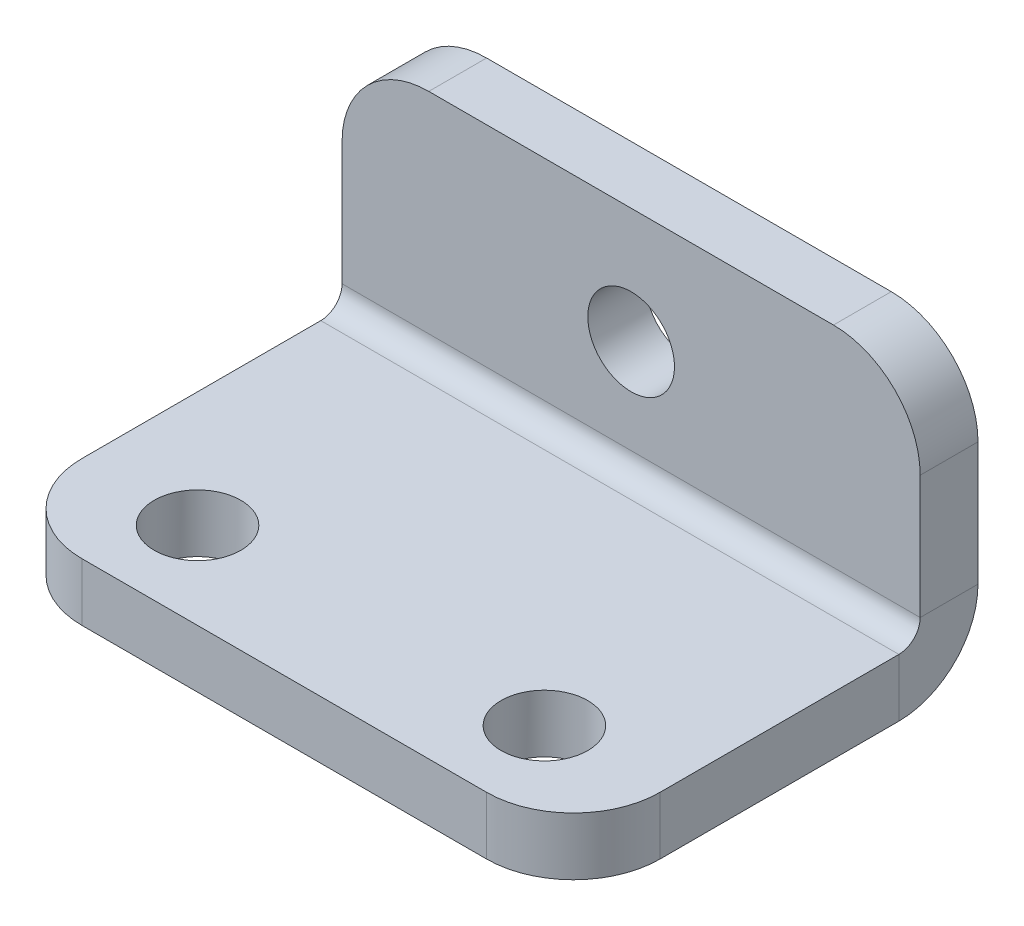
ISO-10303-21;
HEADER;
FILE_DESCRIPTION(('STEP AP214'),'2;1');
FILE_NAME('part.step','',(''),(''),'','','');
FILE_SCHEMA(('AUTOMOTIVE_DESIGN { 1 0 10303 214 1 1 1 1 }'));
ENDSEC;
DATA;
#1=APPLICATION_CONTEXT('core data for automotive mechanical design processes');
#2=APPLICATION_PROTOCOL_DEFINITION('international standard','automotive_design',2000,#1);
#3=PRODUCT_CONTEXT('',#1,'mechanical');
#4=PRODUCT('Part','Part','',(#3));
#5=PRODUCT_RELATED_PRODUCT_CATEGORY('part','',(#4));
#6=PRODUCT_DEFINITION_FORMATION('','',#4);
#7=PRODUCT_DEFINITION_CONTEXT('part definition',#1,'design');
#8=PRODUCT_DEFINITION('design','',#6,#7);
#9=PRODUCT_DEFINITION_SHAPE('','',#8);
#10=(LENGTH_UNIT() NAMED_UNIT(*) SI_UNIT(.MILLI.,.METRE.));
#11=(NAMED_UNIT(*) PLANE_ANGLE_UNIT() SI_UNIT($,.RADIAN.));
#12=(NAMED_UNIT(*) SI_UNIT($,.STERADIAN.) SOLID_ANGLE_UNIT());
#13=UNCERTAINTY_MEASURE_WITH_UNIT(LENGTH_MEASURE(1.E-05),#10,'distance_accuracy_value','');
#14=(GEOMETRIC_REPRESENTATION_CONTEXT(3) GLOBAL_UNCERTAINTY_ASSIGNED_CONTEXT((#13)) GLOBAL_UNIT_ASSIGNED_CONTEXT((#10,
#11,#12)) REPRESENTATION_CONTEXT('',''));
#15=CARTESIAN_POINT('',(0.,0.,0.));
#16=DIRECTION('',(0.,0.,1.));
#17=DIRECTION('',(1.,0.,0.));
#18=AXIS2_PLACEMENT_3D('',#15,#16,#17);
#19=CARTESIAN_POINT('',(10.,0.7366,0.));
#20=DIRECTION('',(1.,0.,0.));
#21=DIRECTION('',(0.,0.,-1.));
#22=AXIS2_PLACEMENT_3D('',#19,#20,#21);
#23=PLANE('',#22);
#24=DIRECTION('',(0.,0.,-1.));
#25=VECTOR('',#24,1.);
#26=CARTESIAN_POINT('',(10.,0.7366,0.));
#27=LINE('',#26,#25);
#28=CARTESIAN_POINT('',(10.,0.7366,0.));
#29=VERTEX_POINT('',#28);
#30=CARTESIAN_POINT('',(10.,0.7366,-2.));
#31=VERTEX_POINT('',#30);
#32=EDGE_CURVE('E139',#29,#31,#27,.T.);
#33=ORIENTED_EDGE('',*,*,#32,.F.);
#34=CARTESIAN_POINT('',(10.,0.7366,0.7366));
#35=DIRECTION('',(1.,0.,0.));
#36=DIRECTION('',(0.,0.,-1.));
#37=AXIS2_PLACEMENT_3D('',#34,#35,#36);
#38=CIRCLE('',#37,0.7366);
#39=CARTESIAN_POINT('',(10.,0.,0.7366));
#40=VERTEX_POINT('',#39);
#41=EDGE_CURVE('E134',#29,#40,#38,.F.);
#42=ORIENTED_EDGE('',*,*,#41,.T.);
#43=DIRECTION('',(0.,1.,0.));
#44=VECTOR('',#43,1.);
#45=CARTESIAN_POINT('',(10.,-2.,0.7366));
#46=LINE('',#45,#44);
#47=CARTESIAN_POINT('',(10.,-2.,0.7366));
#48=VERTEX_POINT('',#47);
#49=EDGE_CURVE('E128',#48,#40,#46,.T.);
#50=ORIENTED_EDGE('',*,*,#49,.F.);
#51=CARTESIAN_POINT('',(10.,0.7366,0.7366));
#52=DIRECTION('',(1.,0.,0.));
#53=DIRECTION('',(0.,0.,-1.));
#54=AXIS2_PLACEMENT_3D('',#51,#52,#53);
#55=CIRCLE('',#54,2.7366);
#56=EDGE_CURVE('E132',#31,#48,#55,.F.);
#57=ORIENTED_EDGE('',*,*,#56,.F.);
#58=EDGE_LOOP('',(#33,#42,#50,#57));
#59=FACE_BOUND('',#58,.T.);
#60=ADVANCED_FACE('F36',(#59),#23,.T.);
#61=CARTESIAN_POINT('',(10.,-2.,0.7366));
#62=DIRECTION('',(1.,0.,0.));
#63=DIRECTION('',(0.,0.,-1.));
#64=AXIS2_PLACEMENT_3D('',#61,#62,#63);
#65=PLANE('',#64);
#66=DIRECTION('',(0.,1.,0.));
#67=VECTOR('',#66,1.);
#68=CARTESIAN_POINT('',(10.,8.,-2.));
#69=LINE('',#68,#67);
#70=CARTESIAN_POINT('',(10.,5.,-2.));
#71=VERTEX_POINT('',#70);
#72=EDGE_CURVE('E166',#71,#31,#69,.F.);
#73=ORIENTED_EDGE('',*,*,#72,.F.);
#74=DIRECTION('',(0.,0.,-1.));
#75=VECTOR('',#74,1.);
#76=CARTESIAN_POINT('',(10.,5.,0.7366));
#77=LINE('',#76,#75);
#78=CARTESIAN_POINT('',(10.,5.,0.));
#79=VERTEX_POINT('',#78);
#80=EDGE_CURVE('E45',#71,#79,#77,.F.);
#81=ORIENTED_EDGE('',*,*,#80,.T.);
#82=DIRECTION('',(0.,-1.,0.));
#83=VECTOR('',#82,1.);
#84=CARTESIAN_POINT('',(10.,8.,0.));
#85=LINE('',#84,#83);
#86=EDGE_CURVE('E168',#79,#29,#85,.T.);
#87=ORIENTED_EDGE('',*,*,#86,.T.);
#88=ORIENTED_EDGE('',*,*,#32,.T.);
#89=EDGE_LOOP('',(#73,#81,#87,#88));
#90=FACE_BOUND('',#89,.T.);
#91=ADVANCED_FACE('F290',(#90),#65,.T.);
#92=CARTESIAN_POINT('',(-10.,0.,0.7366));
#93=DIRECTION('',(-1.,0.,0.));
#94=DIRECTION('',(0.,0.,1.));
#95=AXIS2_PLACEMENT_3D('',#92,#93,#94);
#96=PLANE('',#95);
#97=DIRECTION('',(0.,-1.,0.));
#98=VECTOR('',#97,1.);
#99=CARTESIAN_POINT('',(-10.,0.,0.7366));
#100=LINE('',#99,#98);
#101=CARTESIAN_POINT('',(-10.,0.,0.7366));
#102=VERTEX_POINT('',#101);
#103=CARTESIAN_POINT('',(-10.,-2.,0.7366));
#104=VERTEX_POINT('',#103);
#105=EDGE_CURVE('E140',#102,#104,#100,.T.);
#106=ORIENTED_EDGE('',*,*,#105,.F.);
#107=CARTESIAN_POINT('',(-10.,0.7366,0.7366));
#108=DIRECTION('',(1.,0.,0.));
#109=DIRECTION('',(0.,0.,-1.));
#110=AXIS2_PLACEMENT_3D('',#107,#108,#109);
#111=CIRCLE('',#110,0.7366);
#112=CARTESIAN_POINT('',(-10.,0.7366,0.));
#113=VERTEX_POINT('',#112);
#114=EDGE_CURVE('E185',#113,#102,#111,.F.);
#115=ORIENTED_EDGE('',*,*,#114,.F.);
#116=DIRECTION('',(0.,0.,1.));
#117=VECTOR('',#116,1.);
#118=CARTESIAN_POINT('',(-10.,0.7366,-2.));
#119=LINE('',#118,#117);
#120=CARTESIAN_POINT('',(-10.,0.7366,-2.));
#121=VERTEX_POINT('',#120);
#122=EDGE_CURVE('E202',#121,#113,#119,.T.);
#123=ORIENTED_EDGE('',*,*,#122,.F.);
#124=CARTESIAN_POINT('',(-10.,0.7366,0.7366));
#125=DIRECTION('',(1.,0.,0.));
#126=DIRECTION('',(0.,0.,-1.));
#127=AXIS2_PLACEMENT_3D('',#124,#125,#126);
#128=CIRCLE('',#127,2.7366);
#129=EDGE_CURVE('E179',#121,#104,#128,.F.);
#130=ORIENTED_EDGE('',*,*,#129,.T.);
#131=EDGE_LOOP('',(#106,#115,#123,#130));
#132=FACE_BOUND('',#131,.T.);
#133=ADVANCED_FACE('F273',(#132),#96,.T.);
#134=CARTESIAN_POINT('',(-10.,0.7366,-2.));
#135=DIRECTION('',(-1.,0.,0.));
#136=DIRECTION('',(0.,0.,1.));
#137=AXIS2_PLACEMENT_3D('',#134,#135,#136);
#138=PLANE('',#137);
#139=DIRECTION('',(0.,0.,1.));
#140=VECTOR('',#139,1.);
#141=CARTESIAN_POINT('',(-10.,-2.,0.));
#142=LINE('',#141,#140);
#143=CARTESIAN_POINT('',(-10.,-2.,9.));
#144=VERTEX_POINT('',#143);
#145=EDGE_CURVE('E152',#104,#144,#142,.T.);
#146=ORIENTED_EDGE('',*,*,#145,.T.);
#147=DIRECTION('',(0.,1.,0.));
#148=VECTOR('',#147,1.);
#149=CARTESIAN_POINT('',(-10.,0.7366,9.));
#150=LINE('',#149,#148);
#151=CARTESIAN_POINT('',(-10.,0.,9.));
#152=VERTEX_POINT('',#151);
#153=EDGE_CURVE('E208',#144,#152,#150,.T.);
#154=ORIENTED_EDGE('',*,*,#153,.T.);
#155=DIRECTION('',(0.,0.,1.));
#156=VECTOR('',#155,1.);
#157=CARTESIAN_POINT('',(-10.,0.,0.));
#158=LINE('',#157,#156);
#159=EDGE_CURVE('E175',#102,#152,#158,.T.);
#160=ORIENTED_EDGE('',*,*,#159,.F.);
#161=ORIENTED_EDGE('',*,*,#105,.T.);
#162=EDGE_LOOP('',(#146,#154,#160,#161));
#163=FACE_BOUND('',#162,.T.);
#164=ADVANCED_FACE('F269',(#163),#138,.T.);
#165=CARTESIAN_POINT('',(10.,0.,0.));
#166=DIRECTION('',(0.,-1.,0.));
#167=DIRECTION('',(0.,0.,-1.));
#168=AXIS2_PLACEMENT_3D('',#165,#166,#167);
#169=PLANE('',#168);
#170=CARTESIAN_POINT('',(-6.,0.,9.));
#171=DIRECTION('',(0.,1.,0.));
#172=DIRECTION('',(0.,0.,1.));
#173=AXIS2_PLACEMENT_3D('',#170,#171,#172);
#174=CIRCLE('',#173,1.5);
#175=CARTESIAN_POINT('',(-6.,0.,10.5));
#176=VERTEX_POINT('',#175);
#177=EDGE_CURVE('E241',#176,#176,#174,.T.);
#178=ORIENTED_EDGE('',*,*,#177,.F.);
#179=EDGE_LOOP('',(#178));
#180=FACE_BOUND('',#179,.T.);
#181=CARTESIAN_POINT('',(6.,0.,9.));
#182=DIRECTION('',(0.,1.,0.));
#183=DIRECTION('',(0.,0.,1.));
#184=AXIS2_PLACEMENT_3D('',#181,#182,#183);
#185=CIRCLE('',#184,1.5);
#186=CARTESIAN_POINT('',(6.,0.,10.5));
#187=VERTEX_POINT('',#186);
#188=EDGE_CURVE('E246',#187,#187,#185,.T.);
#189=ORIENTED_EDGE('',*,*,#188,.F.);
#190=EDGE_LOOP('',(#189));
#191=FACE_BOUND('',#190,.T.);
#192=ORIENTED_EDGE('',*,*,#159,.T.);
#193=CARTESIAN_POINT('',(-7.,0.,9.));
#194=DIRECTION('',(0.,-1.,0.));
#195=DIRECTION('',(0.,0.,-1.));
#196=AXIS2_PLACEMENT_3D('',#193,#194,#195);
#197=CIRCLE('',#196,3.);
#198=CARTESIAN_POINT('',(-7.,0.,12.));
#199=VERTEX_POINT('',#198);
#200=EDGE_CURVE('E213',#152,#199,#197,.F.);
#201=ORIENTED_EDGE('',*,*,#200,.T.);
#202=DIRECTION('',(-1.,0.,0.));
#203=VECTOR('',#202,1.);
#204=CARTESIAN_POINT('',(10.,0.,12.));
#205=LINE('',#204,#203);
#206=CARTESIAN_POINT('',(7.,0.,12.));
#207=VERTEX_POINT('',#206);
#208=EDGE_CURVE('E199',#207,#199,#205,.T.);
#209=ORIENTED_EDGE('',*,*,#208,.F.);
#210=CARTESIAN_POINT('',(7.,0.,9.));
#211=DIRECTION('',(0.,-1.,0.));
#212=DIRECTION('',(0.,0.,-1.));
#213=AXIS2_PLACEMENT_3D('',#210,#211,#212);
#214=CIRCLE('',#213,3.);
#215=CARTESIAN_POINT('',(10.,0.,9.));
#216=VERTEX_POINT('',#215);
#217=EDGE_CURVE('E211',#207,#216,#214,.F.);
#218=ORIENTED_EDGE('',*,*,#217,.T.);
#219=DIRECTION('',(0.,0.,1.));
#220=VECTOR('',#219,1.);
#221=CARTESIAN_POINT('',(10.,0.,0.));
#222=LINE('',#221,#220);
#223=EDGE_CURVE('E161',#40,#216,#222,.T.);
#224=ORIENTED_EDGE('',*,*,#223,.F.);
#225=DIRECTION('',(-1.,0.,0.));
#226=VECTOR('',#225,1.);
#227=CARTESIAN_POINT('',(10.,0.,0.7366));
#228=LINE('',#227,#226);
#229=EDGE_CURVE('E174',#40,#102,#228,.T.);
#230=ORIENTED_EDGE('',*,*,#229,.T.);
#231=EDGE_LOOP('',(#192,#201,#209,#218,#224,#230));
#232=FACE_BOUND('',#231,.T.);
#233=ADVANCED_FACE('F278',(#180,#191,#232),#169,.F.);
#234=CARTESIAN_POINT('',(10.,-2.,12.));
#235=DIRECTION('',(0.,0.,1.));
#236=DIRECTION('',(1.,0.,0.));
#237=AXIS2_PLACEMENT_3D('',#234,#235,#236);
#238=PLANE('',#237);
#239=ORIENTED_EDGE('',*,*,#208,.T.);
#240=DIRECTION('',(0.,1.,0.));
#241=VECTOR('',#240,1.);
#242=CARTESIAN_POINT('',(-7.,-2.,12.));
#243=LINE('',#242,#241);
#244=CARTESIAN_POINT('',(-7.,-2.,12.));
#245=VERTEX_POINT('',#244);
#246=EDGE_CURVE('E218',#199,#245,#243,.F.);
#247=ORIENTED_EDGE('',*,*,#246,.T.);
#248=DIRECTION('',(-1.,0.,0.));
#249=VECTOR('',#248,1.);
#250=CARTESIAN_POINT('',(10.,-2.,12.));
#251=LINE('',#250,#249);
#252=CARTESIAN_POINT('',(7.,-2.,12.));
#253=VERTEX_POINT('',#252);
#254=EDGE_CURVE('E156',#253,#245,#251,.T.);
#255=ORIENTED_EDGE('',*,*,#254,.F.);
#256=DIRECTION('',(0.,1.,0.));
#257=VECTOR('',#256,1.);
#258=CARTESIAN_POINT('',(7.,-2.,12.));
#259=LINE('',#258,#257);
#260=EDGE_CURVE('E215',#253,#207,#259,.T.);
#261=ORIENTED_EDGE('',*,*,#260,.T.);
#262=EDGE_LOOP('',(#239,#247,#255,#261));
#263=FACE_BOUND('',#262,.T.);
#264=ADVANCED_FACE('F262',(#263),#238,.T.);
#265=CARTESIAN_POINT('',(10.,-2.,0.));
#266=DIRECTION('',(0.,-1.,0.));
#267=DIRECTION('',(0.,0.,-1.));
#268=AXIS2_PLACEMENT_3D('',#265,#266,#267);
#269=PLANE('',#268);
#270=CARTESIAN_POINT('',(-6.,-2.,9.));
#271=DIRECTION('',(0.,-1.,0.));
#272=DIRECTION('',(0.,0.,-1.));
#273=AXIS2_PLACEMENT_3D('',#270,#271,#272);
#274=CIRCLE('',#273,1.5);
#275=CARTESIAN_POINT('',(-6.,-2.,7.5));
#276=VERTEX_POINT('',#275);
#277=EDGE_CURVE('E40',#276,#276,#274,.T.);
#278=ORIENTED_EDGE('',*,*,#277,.F.);
#279=EDGE_LOOP('',(#278));
#280=FACE_BOUND('',#279,.T.);
#281=CARTESIAN_POINT('',(6.,-2.,9.));
#282=DIRECTION('',(0.,-1.,0.));
#283=DIRECTION('',(0.,0.,-1.));
#284=AXIS2_PLACEMENT_3D('',#281,#282,#283);
#285=CIRCLE('',#284,1.5);
#286=CARTESIAN_POINT('',(6.,-2.,7.5));
#287=VERTEX_POINT('',#286);
#288=EDGE_CURVE('E239',#287,#287,#285,.T.);
#289=ORIENTED_EDGE('',*,*,#288,.F.);
#290=EDGE_LOOP('',(#289));
#291=FACE_BOUND('',#290,.T.);
#292=ORIENTED_EDGE('',*,*,#254,.T.);
#293=CARTESIAN_POINT('',(-7.,-2.,9.));
#294=DIRECTION('',(0.,-1.,0.));
#295=DIRECTION('',(0.,0.,-1.));
#296=AXIS2_PLACEMENT_3D('',#293,#294,#295);
#297=CIRCLE('',#296,3.);
#298=EDGE_CURVE('E222',#245,#144,#297,.T.);
#299=ORIENTED_EDGE('',*,*,#298,.T.);
#300=ORIENTED_EDGE('',*,*,#145,.F.);
#301=DIRECTION('',(-1.,0.,0.));
#302=VECTOR('',#301,1.);
#303=CARTESIAN_POINT('',(10.,-2.,0.7366));
#304=LINE('',#303,#302);
#305=EDGE_CURVE('E146',#48,#104,#304,.T.);
#306=ORIENTED_EDGE('',*,*,#305,.F.);
#307=DIRECTION('',(0.,0.,1.));
#308=VECTOR('',#307,1.);
#309=CARTESIAN_POINT('',(10.,-2.,0.));
#310=LINE('',#309,#308);
#311=CARTESIAN_POINT('',(10.,-2.,9.));
#312=VERTEX_POINT('',#311);
#313=EDGE_CURVE('E149',#48,#312,#310,.T.);
#314=ORIENTED_EDGE('',*,*,#313,.T.);
#315=CARTESIAN_POINT('',(7.,-2.,9.));
#316=DIRECTION('',(0.,-1.,0.));
#317=DIRECTION('',(0.,0.,-1.));
#318=AXIS2_PLACEMENT_3D('',#315,#316,#317);
#319=CIRCLE('',#318,3.);
#320=EDGE_CURVE('E220',#312,#253,#319,.T.);
#321=ORIENTED_EDGE('',*,*,#320,.T.);
#322=EDGE_LOOP('',(#292,#299,#300,#306,#314,#321));
#323=FACE_BOUND('',#322,.T.);
#324=ADVANCED_FACE('F148',(#280,#291,#323),#269,.T.);
#325=CARTESIAN_POINT('',(10.,0.7366,0.7366));
#326=DIRECTION('',(-1.,0.,0.));
#327=DIRECTION('',(0.,0.,1.));
#328=AXIS2_PLACEMENT_3D('',#325,#326,#327);
#329=CYLINDRICAL_SURFACE('',#328,2.7366);
#330=ORIENTED_EDGE('',*,*,#129,.F.);
#331=DIRECTION('',(-1.,0.,0.));
#332=VECTOR('',#331,1.);
#333=CARTESIAN_POINT('',(10.,0.7366,-2.));
#334=LINE('',#333,#332);
#335=EDGE_CURVE('E157',#31,#121,#334,.T.);
#336=ORIENTED_EDGE('',*,*,#335,.F.);
#337=ORIENTED_EDGE('',*,*,#56,.T.);
#338=ORIENTED_EDGE('',*,*,#305,.T.);
#339=EDGE_LOOP('',(#330,#336,#337,#338));
#340=FACE_BOUND('',#339,.T.);
#341=ADVANCED_FACE('F164',(#340),#329,.T.);
#342=CARTESIAN_POINT('',(10.,8.,-2.));
#343=DIRECTION('',(0.,0.,-1.));
#344=DIRECTION('',(-1.,0.,0.));
#345=AXIS2_PLACEMENT_3D('',#342,#343,#344);
#346=PLANE('',#345);
#347=CARTESIAN_POINT('',(0.,4.,-2.));
#348=DIRECTION('',(0.,0.,-1.));
#349=DIRECTION('',(-1.,0.,0.));
#350=AXIS2_PLACEMENT_3D('',#347,#348,#349);
#351=CIRCLE('',#350,1.5);
#352=CARTESIAN_POINT('',(-1.5,4.,-2.));
#353=VERTEX_POINT('',#352);
#354=EDGE_CURVE('E251',#353,#353,#351,.T.);
#355=ORIENTED_EDGE('',*,*,#354,.F.);
#356=EDGE_LOOP('',(#355));
#357=FACE_BOUND('',#356,.T.);
#358=DIRECTION('',(0.,1.,0.));
#359=VECTOR('',#358,1.);
#360=CARTESIAN_POINT('',(-10.,8.,-2.));
#361=LINE('',#360,#359);
#362=CARTESIAN_POINT('',(-10.,5.,-2.));
#363=VERTEX_POINT('',#362);
#364=EDGE_CURVE('E181',#363,#121,#361,.F.);
#365=ORIENTED_EDGE('',*,*,#364,.F.);
#366=CARTESIAN_POINT('',(-7.,5.,-2.));
#367=DIRECTION('',(0.,0.,-1.));
#368=DIRECTION('',(-1.,0.,0.));
#369=AXIS2_PLACEMENT_3D('',#366,#367,#368);
#370=CIRCLE('',#369,3.);
#371=CARTESIAN_POINT('',(-7.,8.,-2.));
#372=VERTEX_POINT('',#371);
#373=EDGE_CURVE('E229',#363,#372,#370,.T.);
#374=ORIENTED_EDGE('',*,*,#373,.T.);
#375=DIRECTION('',(-1.,0.,0.));
#376=VECTOR('',#375,1.);
#377=CARTESIAN_POINT('',(10.,8.,-2.));
#378=LINE('',#377,#376);
#379=CARTESIAN_POINT('',(7.,8.,-2.));
#380=VERTEX_POINT('',#379);
#381=EDGE_CURVE('E195',#380,#372,#378,.T.);
#382=ORIENTED_EDGE('',*,*,#381,.F.);
#383=CARTESIAN_POINT('',(7.,5.,-2.));
#384=DIRECTION('',(0.,0.,-1.));
#385=DIRECTION('',(-1.,0.,0.));
#386=AXIS2_PLACEMENT_3D('',#383,#384,#385);
#387=CIRCLE('',#386,3.);
#388=EDGE_CURVE('E227',#380,#71,#387,.T.);
#389=ORIENTED_EDGE('',*,*,#388,.T.);
#390=ORIENTED_EDGE('',*,*,#72,.T.);
#391=ORIENTED_EDGE('',*,*,#335,.T.);
#392=EDGE_LOOP('',(#365,#374,#382,#389,#390,#391));
#393=FACE_BOUND('',#392,.T.);
#394=ADVANCED_FACE('F320',(#357,#393),#346,.T.);
#395=CARTESIAN_POINT('',(10.,8.,0.));
#396=DIRECTION('',(0.,1.,0.));
#397=DIRECTION('',(0.,0.,1.));
#398=AXIS2_PLACEMENT_3D('',#395,#396,#397);
#399=PLANE('',#398);
#400=ORIENTED_EDGE('',*,*,#381,.T.);
#401=DIRECTION('',(0.,0.,-1.));
#402=VECTOR('',#401,1.);
#403=CARTESIAN_POINT('',(-7.,8.,0.));
#404=LINE('',#403,#402);
#405=CARTESIAN_POINT('',(-7.,8.,0.));
#406=VERTEX_POINT('',#405);
#407=EDGE_CURVE('E60',#372,#406,#404,.F.);
#408=ORIENTED_EDGE('',*,*,#407,.T.);
#409=DIRECTION('',(-1.,0.,0.));
#410=VECTOR('',#409,1.);
#411=CARTESIAN_POINT('',(10.,8.,0.));
#412=LINE('',#411,#410);
#413=CARTESIAN_POINT('',(7.,8.,0.));
#414=VERTEX_POINT('',#413);
#415=EDGE_CURVE('E193',#414,#406,#412,.T.);
#416=ORIENTED_EDGE('',*,*,#415,.F.);
#417=DIRECTION('',(0.,0.,-1.));
#418=VECTOR('',#417,1.);
#419=CARTESIAN_POINT('',(7.,8.,0.));
#420=LINE('',#419,#418);
#421=EDGE_CURVE('E231',#414,#380,#420,.T.);
#422=ORIENTED_EDGE('',*,*,#421,.T.);
#423=EDGE_LOOP('',(#400,#408,#416,#422));
#424=FACE_BOUND('',#423,.T.);
#425=ADVANCED_FACE('F316',(#424),#399,.T.);
#426=CARTESIAN_POINT('',(10.,8.,0.));
#427=DIRECTION('',(0.,0.,-1.));
#428=DIRECTION('',(-1.,0.,0.));
#429=AXIS2_PLACEMENT_3D('',#426,#427,#428);
#430=PLANE('',#429);
#431=CARTESIAN_POINT('',(0.,4.,0.));
#432=DIRECTION('',(0.,0.,1.));
#433=DIRECTION('',(1.,0.,0.));
#434=AXIS2_PLACEMENT_3D('',#431,#432,#433);
#435=CIRCLE('',#434,1.5);
#436=CARTESIAN_POINT('',(1.5,4.,0.));
#437=VERTEX_POINT('',#436);
#438=EDGE_CURVE('E517',#437,#437,#435,.T.);
#439=ORIENTED_EDGE('',*,*,#438,.F.);
#440=EDGE_LOOP('',(#439));
#441=FACE_BOUND('',#440,.T.);
#442=ORIENTED_EDGE('',*,*,#415,.T.);
#443=CARTESIAN_POINT('',(-7.,5.,0.));
#444=DIRECTION('',(0.,0.,-1.));
#445=DIRECTION('',(-1.,0.,0.));
#446=AXIS2_PLACEMENT_3D('',#443,#444,#445);
#447=CIRCLE('',#446,3.);
#448=CARTESIAN_POINT('',(-10.,5.,0.));
#449=VERTEX_POINT('',#448);
#450=EDGE_CURVE('E237',#406,#449,#447,.F.);
#451=ORIENTED_EDGE('',*,*,#450,.T.);
#452=DIRECTION('',(0.,-1.,0.));
#453=VECTOR('',#452,1.);
#454=CARTESIAN_POINT('',(-10.,8.,0.));
#455=LINE('',#454,#453);
#456=EDGE_CURVE('E183',#449,#113,#455,.T.);
#457=ORIENTED_EDGE('',*,*,#456,.T.);
#458=DIRECTION('',(-1.,0.,0.));
#459=VECTOR('',#458,1.);
#460=CARTESIAN_POINT('',(10.,0.7366,0.));
#461=LINE('',#460,#459);
#462=EDGE_CURVE('E190',#29,#113,#461,.T.);
#463=ORIENTED_EDGE('',*,*,#462,.F.);
#464=ORIENTED_EDGE('',*,*,#86,.F.);
#465=CARTESIAN_POINT('',(7.,5.,0.));
#466=DIRECTION('',(0.,0.,-1.));
#467=DIRECTION('',(-1.,0.,0.));
#468=AXIS2_PLACEMENT_3D('',#465,#466,#467);
#469=CIRCLE('',#468,3.);
#470=EDGE_CURVE('E235',#79,#414,#469,.F.);
#471=ORIENTED_EDGE('',*,*,#470,.T.);
#472=EDGE_LOOP('',(#442,#451,#457,#463,#464,#471));
#473=FACE_BOUND('',#472,.T.);
#474=ADVANCED_FACE('F314',(#441,#473),#430,.F.);
#475=CARTESIAN_POINT('',(10.,0.7366,0.7366));
#476=DIRECTION('',(-1.,0.,0.));
#477=DIRECTION('',(0.,0.,1.));
#478=AXIS2_PLACEMENT_3D('',#475,#476,#477);
#479=CYLINDRICAL_SURFACE('',#478,0.7366);
#480=ORIENTED_EDGE('',*,*,#114,.T.);
#481=ORIENTED_EDGE('',*,*,#229,.F.);
#482=ORIENTED_EDGE('',*,*,#41,.F.);
#483=ORIENTED_EDGE('',*,*,#462,.T.);
#484=EDGE_LOOP('',(#480,#481,#482,#483));
#485=FACE_BOUND('',#484,.T.);
#486=ADVANCED_FACE('F276',(#485),#479,.F.);
#487=CARTESIAN_POINT('',(10.,0.7366,0.7366));
#488=DIRECTION('',(1.,0.,0.));
#489=DIRECTION('',(0.,0.,-1.));
#490=AXIS2_PLACEMENT_3D('',#487,#488,#489);
#491=PLANE('',#490);
#492=ORIENTED_EDGE('',*,*,#223,.T.);
#493=DIRECTION('',(0.,1.,0.));
#494=VECTOR('',#493,1.);
#495=CARTESIAN_POINT('',(10.,0.7366,9.));
#496=LINE('',#495,#494);
#497=EDGE_CURVE('E11',#216,#312,#496,.F.);
#498=ORIENTED_EDGE('',*,*,#497,.T.);
#499=ORIENTED_EDGE('',*,*,#313,.F.);
#500=ORIENTED_EDGE('',*,*,#49,.T.);
#501=EDGE_LOOP('',(#492,#498,#499,#500));
#502=FACE_BOUND('',#501,.T.);
#503=ADVANCED_FACE('F159',(#502),#491,.T.);
#504=CARTESIAN_POINT('',(-10.,0.7366,0.7366));
#505=DIRECTION('',(1.,0.,0.));
#506=DIRECTION('',(0.,0.,-1.));
#507=AXIS2_PLACEMENT_3D('',#504,#505,#506);
#508=PLANE('',#507);
#509=ORIENTED_EDGE('',*,*,#456,.F.);
#510=DIRECTION('',(0.,0.,-1.));
#511=VECTOR('',#510,1.);
#512=CARTESIAN_POINT('',(-10.,5.,-2.));
#513=LINE('',#512,#511);
#514=EDGE_CURVE('E224',#449,#363,#513,.T.);
#515=ORIENTED_EDGE('',*,*,#514,.T.);
#516=ORIENTED_EDGE('',*,*,#364,.T.);
#517=ORIENTED_EDGE('',*,*,#122,.T.);
#518=EDGE_LOOP('',(#509,#515,#516,#517));
#519=FACE_BOUND('',#518,.T.);
#520=ADVANCED_FACE('F301',(#519),#508,.F.);
#521=CARTESIAN_POINT('',(-7.,0.7366,9.));
#522=DIRECTION('',(0.,1.,0.));
#523=DIRECTION('',(0.,0.,1.));
#524=AXIS2_PLACEMENT_3D('',#521,#522,#523);
#525=CYLINDRICAL_SURFACE('',#524,3.);
#526=ORIENTED_EDGE('',*,*,#298,.F.);
#527=ORIENTED_EDGE('',*,*,#246,.F.);
#528=ORIENTED_EDGE('',*,*,#200,.F.);
#529=ORIENTED_EDGE('',*,*,#153,.F.);
#530=EDGE_LOOP('',(#526,#527,#528,#529));
#531=FACE_BOUND('',#530,.T.);
#532=ADVANCED_FACE('F266',(#531),#525,.T.);
#533=CARTESIAN_POINT('',(-7.,5.,0.7366));
#534=DIRECTION('',(0.,0.,1.));
#535=DIRECTION('',(1.,0.,0.));
#536=AXIS2_PLACEMENT_3D('',#533,#534,#535);
#537=CYLINDRICAL_SURFACE('',#536,3.);
#538=ORIENTED_EDGE('',*,*,#450,.F.);
#539=ORIENTED_EDGE('',*,*,#407,.F.);
#540=ORIENTED_EDGE('',*,*,#373,.F.);
#541=ORIENTED_EDGE('',*,*,#514,.F.);
#542=EDGE_LOOP('',(#538,#539,#540,#541));
#543=FACE_BOUND('',#542,.T.);
#544=ADVANCED_FACE('F300',(#543),#537,.T.);
#545=CARTESIAN_POINT('',(7.,5.,0.));
#546=DIRECTION('',(0.,0.,-1.));
#547=DIRECTION('',(-1.,0.,0.));
#548=AXIS2_PLACEMENT_3D('',#545,#546,#547);
#549=CYLINDRICAL_SURFACE('',#548,3.);
#550=ORIENTED_EDGE('',*,*,#470,.F.);
#551=ORIENTED_EDGE('',*,*,#80,.F.);
#552=ORIENTED_EDGE('',*,*,#388,.F.);
#553=ORIENTED_EDGE('',*,*,#421,.F.);
#554=EDGE_LOOP('',(#550,#551,#552,#553));
#555=FACE_BOUND('',#554,.T.);
#556=ADVANCED_FACE('F303',(#555),#549,.T.);
#557=CARTESIAN_POINT('',(7.,-2.,9.));
#558=DIRECTION('',(0.,1.,0.));
#559=DIRECTION('',(0.,0.,1.));
#560=AXIS2_PLACEMENT_3D('',#557,#558,#559);
#561=CYLINDRICAL_SURFACE('',#560,3.);
#562=ORIENTED_EDGE('',*,*,#320,.F.);
#563=ORIENTED_EDGE('',*,*,#497,.F.);
#564=ORIENTED_EDGE('',*,*,#217,.F.);
#565=ORIENTED_EDGE('',*,*,#260,.F.);
#566=EDGE_LOOP('',(#562,#563,#564,#565));
#567=FACE_BOUND('',#566,.T.);
#568=ADVANCED_FACE('F38',(#567),#561,.T.);
#569=CARTESIAN_POINT('',(6.,-10.,9.));
#570=DIRECTION('',(0.,1.,0.));
#571=DIRECTION('',(0.,0.,1.));
#572=AXIS2_PLACEMENT_3D('',#569,#570,#571);
#573=CYLINDRICAL_SURFACE('',#572,1.5);
#574=ORIENTED_EDGE('',*,*,#288,.T.);
#575=EDGE_LOOP('',(#574));
#576=FACE_BOUND('',#575,.T.);
#577=ORIENTED_EDGE('',*,*,#188,.T.);
#578=EDGE_LOOP('',(#577));
#579=FACE_BOUND('',#578,.T.);
#580=ADVANCED_FACE('F310',(#576,#579),#573,.F.);
#581=CARTESIAN_POINT('',(-6.,-10.,9.));
#582=DIRECTION('',(0.,1.,0.));
#583=DIRECTION('',(0.,0.,1.));
#584=AXIS2_PLACEMENT_3D('',#581,#582,#583);
#585=CYLINDRICAL_SURFACE('',#584,1.5);
#586=ORIENTED_EDGE('',*,*,#277,.T.);
#587=EDGE_LOOP('',(#586));
#588=FACE_BOUND('',#587,.T.);
#589=ORIENTED_EDGE('',*,*,#177,.T.);
#590=EDGE_LOOP('',(#589));
#591=FACE_BOUND('',#590,.T.);
#592=ADVANCED_FACE('F351',(#588,#591),#585,.F.);
#593=CARTESIAN_POINT('',(0.,4.,-10.));
#594=DIRECTION('',(0.,0.,1.));
#595=DIRECTION('',(1.,0.,0.));
#596=AXIS2_PLACEMENT_3D('',#593,#594,#595);
#597=CYLINDRICAL_SURFACE('',#596,1.5);
#598=ORIENTED_EDGE('',*,*,#354,.T.);
#599=EDGE_LOOP('',(#598));
#600=FACE_BOUND('',#599,.T.);
#601=ORIENTED_EDGE('',*,*,#438,.T.);
#602=EDGE_LOOP('',(#601));
#603=FACE_BOUND('',#602,.T.);
#604=ADVANCED_FACE('F353',(#600,#603),#597,.F.);
#605=CLOSED_SHELL('',(#60,#91,#133,#164,#233,#264,#324,#341,#394,#425,#474,#486,#503,#520,#532,
#544,#556,#568,#580,#592,#604));
#606=MANIFOLD_SOLID_BREP('B2',#605);
#607=ADVANCED_BREP_SHAPE_REPRESENTATION('',(#18,#606),#14);
#608=SHAPE_DEFINITION_REPRESENTATION(#9,#607);
ENDSEC;
END-ISO-10303-21;
